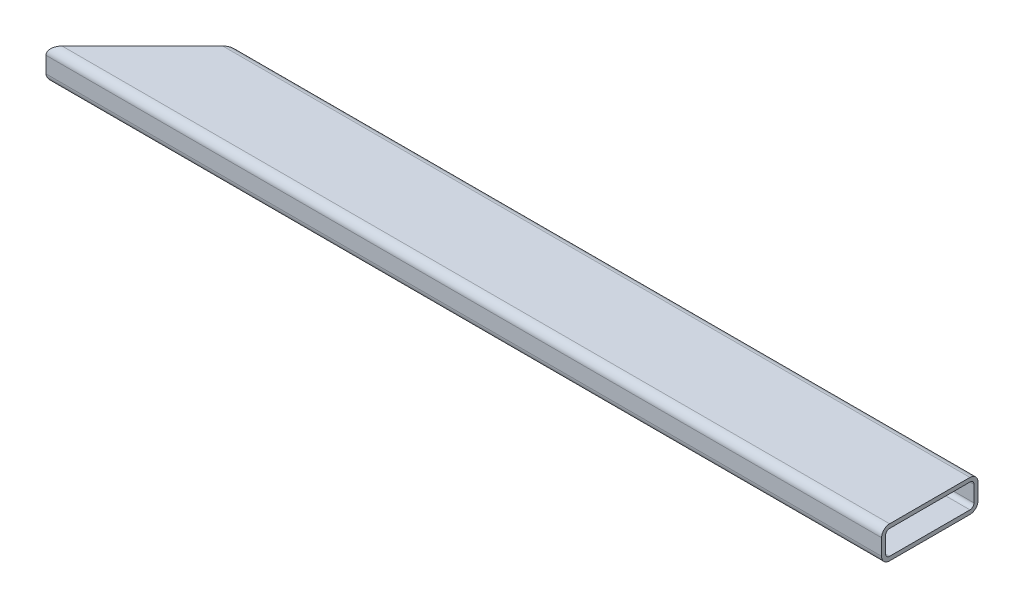
ISO-10303-21;
HEADER;
FILE_DESCRIPTION(('STEP AP214'),'2;1');
FILE_NAME('part.step','',(''),(''),'','','');
FILE_SCHEMA(('AUTOMOTIVE_DESIGN { 1 0 10303 214 1 1 1 1 }'));
ENDSEC;
DATA;
#1=APPLICATION_CONTEXT('core data for automotive mechanical design processes');
#2=APPLICATION_PROTOCOL_DEFINITION('international standard','automotive_design',2000,#1);
#3=PRODUCT_CONTEXT('',#1,'mechanical');
#4=PRODUCT('Part','Part','',(#3));
#5=PRODUCT_RELATED_PRODUCT_CATEGORY('part','',(#4));
#6=PRODUCT_DEFINITION_FORMATION('','',#4);
#7=PRODUCT_DEFINITION_CONTEXT('part definition',#1,'design');
#8=PRODUCT_DEFINITION('design','',#6,#7);
#9=PRODUCT_DEFINITION_SHAPE('','',#8);
#10=(LENGTH_UNIT() NAMED_UNIT(*) SI_UNIT(.MILLI.,.METRE.));
#11=(NAMED_UNIT(*) PLANE_ANGLE_UNIT() SI_UNIT($,.RADIAN.));
#12=(NAMED_UNIT(*) SI_UNIT($,.STERADIAN.) SOLID_ANGLE_UNIT());
#13=UNCERTAINTY_MEASURE_WITH_UNIT(LENGTH_MEASURE(1.E-05),#10,'distance_accuracy_value','');
#14=(GEOMETRIC_REPRESENTATION_CONTEXT(3) GLOBAL_UNCERTAINTY_ASSIGNED_CONTEXT((#13)) GLOBAL_UNIT_ASSIGNED_CONTEXT((#10,
#11,#12)) REPRESENTATION_CONTEXT('',''));
#15=CARTESIAN_POINT('',(0.,0.,0.));
#16=DIRECTION('',(0.,0.,1.));
#17=DIRECTION('',(1.,0.,0.));
#18=AXIS2_PLACEMENT_3D('',#15,#16,#17);
#19=CARTESIAN_POINT('',(660.4,0.,0.));
#20=DIRECTION('',(0.,0.,-1.));
#21=DIRECTION('',(-1.,0.,0.));
#22=AXIS2_PLACEMENT_3D('',#19,#20,#21);
#23=PLANE('',#22);
#24=DIRECTION('',(0.,-1.,0.));
#25=VECTOR('',#24,1.);
#26=CARTESIAN_POINT('',(0.,0.,0.));
#27=LINE('',#26,#25);
#28=CARTESIAN_POINT('',(0.,19.05,0.));
#29=VERTEX_POINT('',#28);
#30=CARTESIAN_POINT('',(0.,6.35,0.));
#31=VERTEX_POINT('',#30);
#32=EDGE_CURVE('E154',#29,#31,#27,.T.);
#33=ORIENTED_EDGE('',*,*,#32,.T.);
#34=DIRECTION('',(-1.,0.,0.));
#35=VECTOR('',#34,1.);
#36=CARTESIAN_POINT('',(660.4,6.35,0.));
#37=LINE('',#36,#35);
#38=CARTESIAN_POINT('',(660.4,6.35,0.));
#39=VERTEX_POINT('',#38);
#40=EDGE_CURVE('E44',#31,#39,#37,.F.);
#41=ORIENTED_EDGE('',*,*,#40,.T.);
#42=DIRECTION('',(0.,-1.,0.));
#43=VECTOR('',#42,1.);
#44=CARTESIAN_POINT('',(660.4,0.,0.));
#45=LINE('',#44,#43);
#46=CARTESIAN_POINT('',(660.4,19.05,0.));
#47=VERTEX_POINT('',#46);
#48=EDGE_CURVE('E186',#47,#39,#45,.T.);
#49=ORIENTED_EDGE('',*,*,#48,.F.);
#50=DIRECTION('',(-1.,0.,0.));
#51=VECTOR('',#50,1.);
#52=CARTESIAN_POINT('',(660.4,19.05,0.));
#53=LINE('',#52,#51);
#54=EDGE_CURVE('E176',#47,#29,#53,.T.);
#55=ORIENTED_EDGE('',*,*,#54,.T.);
#56=EDGE_LOOP('',(#33,#41,#49,#55));
#57=FACE_BOUND('',#56,.T.);
#58=ADVANCED_FACE('F36',(#57),#23,.F.);
#59=CARTESIAN_POINT('',(660.4,0.,0.));
#60=DIRECTION('',(0.,1.,0.));
#61=DIRECTION('',(0.,0.,1.));
#62=AXIS2_PLACEMENT_3D('',#59,#60,#61);
#63=PLANE('',#62);
#64=DIRECTION('',(-1.,0.,0.));
#65=VECTOR('',#64,1.);
#66=CARTESIAN_POINT('',(660.4,0.,-6.35));
#67=LINE('',#66,#65);
#68=CARTESIAN_POINT('',(660.4,0.,-6.35));
#69=VERTEX_POINT('',#68);
#70=CARTESIAN_POINT('',(6.35000000000007,0.,-6.35));
#71=VERTEX_POINT('',#70);
#72=EDGE_CURVE('E200',#69,#71,#67,.T.);
#73=ORIENTED_EDGE('',*,*,#72,.T.);
#74=DIRECTION('',(0.707106781186551,0.,-0.707106781186544));
#75=VECTOR('',#74,1.);
#76=CARTESIAN_POINT('',(0.,0.,0.));
#77=LINE('',#76,#75);
#78=CARTESIAN_POINT('',(69.8500000000007,0.,-69.85));
#79=VERTEX_POINT('',#78);
#80=EDGE_CURVE('E170',#71,#79,#77,.T.);
#81=ORIENTED_EDGE('',*,*,#80,.T.);
#82=DIRECTION('',(-1.,0.,0.));
#83=VECTOR('',#82,1.);
#84=CARTESIAN_POINT('',(660.4,0.,-69.85));
#85=LINE('',#84,#83);
#86=CARTESIAN_POINT('',(660.4,0.,-69.85));
#87=VERTEX_POINT('',#86);
#88=EDGE_CURVE('E202',#79,#87,#85,.F.);
#89=ORIENTED_EDGE('',*,*,#88,.T.);
#90=DIRECTION('',(0.,0.,-1.));
#91=VECTOR('',#90,1.);
#92=CARTESIAN_POINT('',(660.4,0.,0.));
#93=LINE('',#92,#91);
#94=EDGE_CURVE('E195',#69,#87,#93,.T.);
#95=ORIENTED_EDGE('',*,*,#94,.F.);
#96=EDGE_LOOP('',(#73,#81,#89,#95));
#97=FACE_BOUND('',#96,.T.);
#98=ADVANCED_FACE('F282',(#97),#63,.F.);
#99=CARTESIAN_POINT('',(660.4,0.,-76.2));
#100=DIRECTION('',(0.,0.,1.));
#101=DIRECTION('',(1.,0.,0.));
#102=AXIS2_PLACEMENT_3D('',#99,#100,#101);
#103=PLANE('',#102);
#104=DIRECTION('',(-1.,0.,0.));
#105=VECTOR('',#104,1.);
#106=CARTESIAN_POINT('',(660.4,6.35,-76.2));
#107=LINE('',#106,#105);
#108=CARTESIAN_POINT('',(660.4,6.35,-76.2));
#109=VERTEX_POINT('',#108);
#110=CARTESIAN_POINT('',(76.2000000000008,6.35,-76.2));
#111=VERTEX_POINT('',#110);
#112=EDGE_CURVE('E207',#109,#111,#107,.T.);
#113=ORIENTED_EDGE('',*,*,#112,.T.);
#114=DIRECTION('',(0.,1.,0.));
#115=VECTOR('',#114,1.);
#116=CARTESIAN_POINT('',(76.2000000000008,0.,-76.2));
#117=LINE('',#116,#115);
#118=CARTESIAN_POINT('',(76.2000000000008,19.05,-76.2));
#119=VERTEX_POINT('',#118);
#120=EDGE_CURVE('E276',#111,#119,#117,.T.);
#121=ORIENTED_EDGE('',*,*,#120,.T.);
#122=DIRECTION('',(-1.,0.,0.));
#123=VECTOR('',#122,1.);
#124=CARTESIAN_POINT('',(660.4,19.05,-76.2));
#125=LINE('',#124,#123);
#126=CARTESIAN_POINT('',(660.4,19.05,-76.2));
#127=VERTEX_POINT('',#126);
#128=EDGE_CURVE('E210',#119,#127,#125,.F.);
#129=ORIENTED_EDGE('',*,*,#128,.T.);
#130=DIRECTION('',(0.,1.,0.));
#131=VECTOR('',#130,1.);
#132=CARTESIAN_POINT('',(660.4,0.,-76.2));
#133=LINE('',#132,#131);
#134=EDGE_CURVE('E215',#109,#127,#133,.T.);
#135=ORIENTED_EDGE('',*,*,#134,.F.);
#136=EDGE_LOOP('',(#113,#121,#129,#135));
#137=FACE_BOUND('',#136,.T.);
#138=ADVANCED_FACE('F291',(#137),#103,.F.);
#139=CARTESIAN_POINT('',(660.4,25.4,0.));
#140=DIRECTION('',(0.,-1.,0.));
#141=DIRECTION('',(0.,0.,-1.));
#142=AXIS2_PLACEMENT_3D('',#139,#140,#141);
#143=PLANE('',#142);
#144=DIRECTION('',(-1.,0.,0.));
#145=VECTOR('',#144,1.);
#146=CARTESIAN_POINT('',(660.4,25.4,-69.85));
#147=LINE('',#146,#145);
#148=CARTESIAN_POINT('',(660.4,25.4,-69.85));
#149=VERTEX_POINT('',#148);
#150=CARTESIAN_POINT('',(69.8500000000007,25.4,-69.85));
#151=VERTEX_POINT('',#150);
#152=EDGE_CURVE('E169',#149,#151,#147,.T.);
#153=ORIENTED_EDGE('',*,*,#152,.T.);
#154=DIRECTION('',(0.707106781186551,0.,-0.707106781186544));
#155=VECTOR('',#154,1.);
#156=CARTESIAN_POINT('',(0.,25.4,0.));
#157=LINE('',#156,#155);
#158=CARTESIAN_POINT('',(6.35000000000007,25.4,-6.35));
#159=VERTEX_POINT('',#158);
#160=EDGE_CURVE('E151',#159,#151,#157,.T.);
#161=ORIENTED_EDGE('',*,*,#160,.F.);
#162=DIRECTION('',(-1.,0.,0.));
#163=VECTOR('',#162,1.);
#164=CARTESIAN_POINT('',(660.4,25.4,-6.35));
#165=LINE('',#164,#163);
#166=CARTESIAN_POINT('',(660.4,25.4,-6.35));
#167=VERTEX_POINT('',#166);
#168=EDGE_CURVE('E166',#159,#167,#165,.F.);
#169=ORIENTED_EDGE('',*,*,#168,.T.);
#170=DIRECTION('',(0.,0.,1.));
#171=VECTOR('',#170,1.);
#172=CARTESIAN_POINT('',(660.4,25.4,0.));
#173=LINE('',#172,#171);
#174=EDGE_CURVE('E212',#149,#167,#173,.T.);
#175=ORIENTED_EDGE('',*,*,#174,.F.);
#176=EDGE_LOOP('',(#153,#161,#169,#175));
#177=FACE_BOUND('',#176,.T.);
#178=ADVANCED_FACE('F164',(#177),#143,.F.);
#179=CARTESIAN_POINT('',(660.4,0.,0.));
#180=DIRECTION('',(-1.,0.,0.));
#181=DIRECTION('',(0.,0.,1.));
#182=AXIS2_PLACEMENT_3D('',#179,#180,#181);
#183=PLANE('',#182);
#184=DIRECTION('',(0.,0.,-1.));
#185=VECTOR('',#184,1.);
#186=CARTESIAN_POINT('',(660.4,3.175,0.));
#187=LINE('',#186,#185);
#188=CARTESIAN_POINT('',(660.4,3.175,-6.35));
#189=VERTEX_POINT('',#188);
#190=CARTESIAN_POINT('',(660.4,3.175,-69.85));
#191=VERTEX_POINT('',#190);
#192=EDGE_CURVE('E233',#189,#191,#187,.T.);
#193=ORIENTED_EDGE('',*,*,#192,.F.);
#194=CARTESIAN_POINT('',(660.4,6.35,-6.35));
#195=DIRECTION('',(-1.,0.,0.));
#196=DIRECTION('',(0.,0.,1.));
#197=AXIS2_PLACEMENT_3D('',#194,#195,#196);
#198=CIRCLE('',#197,3.175);
#199=CARTESIAN_POINT('',(660.4,6.35,-3.175));
#200=VERTEX_POINT('',#199);
#201=EDGE_CURVE('E221',#200,#189,#198,.F.);
#202=ORIENTED_EDGE('',*,*,#201,.F.);
#203=DIRECTION('',(0.,-1.,0.));
#204=VECTOR('',#203,1.);
#205=CARTESIAN_POINT('',(660.4,0.,-3.175));
#206=LINE('',#205,#204);
#207=CARTESIAN_POINT('',(660.4,19.05,-3.175));
#208=VERTEX_POINT('',#207);
#209=EDGE_CURVE('E238',#208,#200,#206,.T.);
#210=ORIENTED_EDGE('',*,*,#209,.F.);
#211=CARTESIAN_POINT('',(660.4,19.05,-6.35));
#212=DIRECTION('',(-1.,0.,0.));
#213=DIRECTION('',(0.,0.,1.));
#214=AXIS2_PLACEMENT_3D('',#211,#212,#213);
#215=CIRCLE('',#214,3.175);
#216=CARTESIAN_POINT('',(660.4,22.225,-6.35));
#217=VERTEX_POINT('',#216);
#218=EDGE_CURVE('E219',#217,#208,#215,.F.);
#219=ORIENTED_EDGE('',*,*,#218,.F.);
#220=DIRECTION('',(0.,0.,1.));
#221=VECTOR('',#220,1.);
#222=CARTESIAN_POINT('',(660.4,22.225,0.));
#223=LINE('',#222,#221);
#224=CARTESIAN_POINT('',(660.4,22.225,-69.85));
#225=VERTEX_POINT('',#224);
#226=EDGE_CURVE('E223',#225,#217,#223,.T.);
#227=ORIENTED_EDGE('',*,*,#226,.F.);
#228=CARTESIAN_POINT('',(660.4,19.05,-69.85));
#229=DIRECTION('',(-1.,0.,0.));
#230=DIRECTION('',(0.,0.,1.));
#231=AXIS2_PLACEMENT_3D('',#228,#229,#230);
#232=CIRCLE('',#231,3.175);
#233=CARTESIAN_POINT('',(660.4,19.05,-73.025));
#234=VERTEX_POINT('',#233);
#235=EDGE_CURVE('E228',#234,#225,#232,.F.);
#236=ORIENTED_EDGE('',*,*,#235,.F.);
#237=DIRECTION('',(0.,1.,0.));
#238=VECTOR('',#237,1.);
#239=CARTESIAN_POINT('',(660.4,0.,-73.025));
#240=LINE('',#239,#238);
#241=CARTESIAN_POINT('',(660.4,6.35,-73.025));
#242=VERTEX_POINT('',#241);
#243=EDGE_CURVE('E227',#242,#234,#240,.T.);
#244=ORIENTED_EDGE('',*,*,#243,.F.);
#245=CARTESIAN_POINT('',(660.4,6.35,-69.85));
#246=DIRECTION('',(-1.,0.,0.));
#247=DIRECTION('',(0.,0.,1.));
#248=AXIS2_PLACEMENT_3D('',#245,#246,#247);
#249=CIRCLE('',#248,3.175);
#250=EDGE_CURVE('E230',#191,#242,#249,.F.);
#251=ORIENTED_EDGE('',*,*,#250,.F.);
#252=EDGE_LOOP('',(#193,#202,#210,#219,#227,#236,#244,#251));
#253=FACE_BOUND('',#252,.T.);
#254=ORIENTED_EDGE('',*,*,#94,.T.);
#255=CARTESIAN_POINT('',(660.4,6.35,-69.85));
#256=DIRECTION('',(-1.,0.,0.));
#257=DIRECTION('',(0.,0.,1.));
#258=AXIS2_PLACEMENT_3D('',#255,#256,#257);
#259=CIRCLE('',#258,6.35);
#260=EDGE_CURVE('E174',#87,#109,#259,.F.);
#261=ORIENTED_EDGE('',*,*,#260,.T.);
#262=ORIENTED_EDGE('',*,*,#134,.T.);
#263=CARTESIAN_POINT('',(660.4,19.05,-69.85));
#264=DIRECTION('',(-1.,0.,0.));
#265=DIRECTION('',(0.,0.,1.));
#266=AXIS2_PLACEMENT_3D('',#263,#264,#265);
#267=CIRCLE('',#266,6.35);
#268=EDGE_CURVE('E178',#127,#149,#267,.F.);
#269=ORIENTED_EDGE('',*,*,#268,.T.);
#270=ORIENTED_EDGE('',*,*,#174,.T.);
#271=CARTESIAN_POINT('',(660.4,19.05,-6.35));
#272=DIRECTION('',(-1.,0.,0.));
#273=DIRECTION('',(0.,0.,1.));
#274=AXIS2_PLACEMENT_3D('',#271,#272,#273);
#275=CIRCLE('',#274,6.35);
#276=EDGE_CURVE('E173',#167,#47,#275,.F.);
#277=ORIENTED_EDGE('',*,*,#276,.T.);
#278=ORIENTED_EDGE('',*,*,#48,.T.);
#279=CARTESIAN_POINT('',(660.4,6.35,-6.35));
#280=DIRECTION('',(-1.,0.,0.));
#281=DIRECTION('',(0.,0.,1.));
#282=AXIS2_PLACEMENT_3D('',#279,#280,#281);
#283=CIRCLE('',#282,6.35);
#284=EDGE_CURVE('E193',#39,#69,#283,.F.);
#285=ORIENTED_EDGE('',*,*,#284,.T.);
#286=EDGE_LOOP('',(#254,#261,#262,#269,#270,#277,#278,#285));
#287=FACE_BOUND('',#286,.T.);
#288=ADVANCED_FACE('F192',(#253,#287),#183,.F.);
#289=CARTESIAN_POINT('',(660.4,6.35,-69.85));
#290=DIRECTION('',(-1.,0.,0.));
#291=DIRECTION('',(0.,0.,1.));
#292=AXIS2_PLACEMENT_3D('',#289,#290,#291);
#293=CYLINDRICAL_SURFACE('',#292,6.35);
#294=CARTESIAN_POINT('',(69.8500000000007,6.35,-69.85));
#295=DIRECTION('',(0.707106781186544,0.,0.707106781186551));
#296=DIRECTION('',(-0.707106781186551,0.,0.707106781186544));
#297=AXIS2_PLACEMENT_3D('',#294,#295,#296);
#298=ELLIPSE('',#297,8.9802561210692,6.35);
#299=EDGE_CURVE('E241',#111,#79,#298,.F.);
#300=ORIENTED_EDGE('',*,*,#299,.F.);
#301=ORIENTED_EDGE('',*,*,#112,.F.);
#302=ORIENTED_EDGE('',*,*,#260,.F.);
#303=ORIENTED_EDGE('',*,*,#88,.F.);
#304=EDGE_LOOP('',(#300,#301,#302,#303));
#305=FACE_BOUND('',#304,.T.);
#306=ADVANCED_FACE('F286',(#305),#293,.T.);
#307=CARTESIAN_POINT('',(660.4,19.05,-69.85));
#308=DIRECTION('',(-1.,0.,0.));
#309=DIRECTION('',(0.,0.,1.));
#310=AXIS2_PLACEMENT_3D('',#307,#308,#309);
#311=CYLINDRICAL_SURFACE('',#310,6.35);
#312=CARTESIAN_POINT('',(69.8500000000007,19.05,-69.85));
#313=DIRECTION('',(0.707106781186544,0.,0.707106781186551));
#314=DIRECTION('',(-0.707106781186551,0.,0.707106781186544));
#315=AXIS2_PLACEMENT_3D('',#312,#313,#314);
#316=ELLIPSE('',#315,8.9802561210692,6.35);
#317=EDGE_CURVE('E259',#151,#119,#316,.F.);
#318=ORIENTED_EDGE('',*,*,#317,.F.);
#319=ORIENTED_EDGE('',*,*,#152,.F.);
#320=ORIENTED_EDGE('',*,*,#268,.F.);
#321=ORIENTED_EDGE('',*,*,#128,.F.);
#322=EDGE_LOOP('',(#318,#319,#320,#321));
#323=FACE_BOUND('',#322,.T.);
#324=ADVANCED_FACE('F294',(#323),#311,.T.);
#325=CARTESIAN_POINT('',(660.4,6.35,-6.35));
#326=DIRECTION('',(-1.,0.,0.));
#327=DIRECTION('',(0.,0.,1.));
#328=AXIS2_PLACEMENT_3D('',#325,#326,#327);
#329=CYLINDRICAL_SURFACE('',#328,6.35);
#330=CARTESIAN_POINT('',(6.35000000000008,6.35,-6.35));
#331=DIRECTION('',(0.707106781186544,0.,0.707106781186551));
#332=DIRECTION('',(-0.707106781186551,0.,0.707106781186544));
#333=AXIS2_PLACEMENT_3D('',#330,#331,#332);
#334=ELLIPSE('',#333,8.9802561210692,6.35);
#335=EDGE_CURVE('E159',#71,#31,#334,.F.);
#336=ORIENTED_EDGE('',*,*,#335,.F.);
#337=ORIENTED_EDGE('',*,*,#72,.F.);
#338=ORIENTED_EDGE('',*,*,#284,.F.);
#339=ORIENTED_EDGE('',*,*,#40,.F.);
#340=EDGE_LOOP('',(#336,#337,#338,#339));
#341=FACE_BOUND('',#340,.T.);
#342=ADVANCED_FACE('F198',(#341),#329,.T.);
#343=CARTESIAN_POINT('',(660.4,19.05,-6.35));
#344=DIRECTION('',(-1.,0.,0.));
#345=DIRECTION('',(0.,0.,1.));
#346=AXIS2_PLACEMENT_3D('',#343,#344,#345);
#347=CYLINDRICAL_SURFACE('',#346,6.35);
#348=CARTESIAN_POINT('',(6.35000000000008,19.05,-6.35));
#349=DIRECTION('',(0.707106781186544,0.,0.707106781186551));
#350=DIRECTION('',(-0.707106781186551,0.,0.707106781186544));
#351=AXIS2_PLACEMENT_3D('',#348,#349,#350);
#352=ELLIPSE('',#351,8.9802561210692,6.35);
#353=EDGE_CURVE('E148',#29,#159,#352,.F.);
#354=ORIENTED_EDGE('',*,*,#353,.F.);
#355=ORIENTED_EDGE('',*,*,#54,.F.);
#356=ORIENTED_EDGE('',*,*,#276,.F.);
#357=ORIENTED_EDGE('',*,*,#168,.F.);
#358=EDGE_LOOP('',(#354,#355,#356,#357));
#359=FACE_BOUND('',#358,.T.);
#360=ADVANCED_FACE('F38',(#359),#347,.T.);
#361=CARTESIAN_POINT('',(660.4,0.,-3.175));
#362=DIRECTION('',(0.,0.,-1.));
#363=DIRECTION('',(-1.,0.,0.));
#364=AXIS2_PLACEMENT_3D('',#361,#362,#363);
#365=PLANE('',#364);
#366=DIRECTION('',(0.,-1.,0.));
#367=VECTOR('',#366,1.);
#368=CARTESIAN_POINT('',(3.17500000000004,0.,-3.175));
#369=LINE('',#368,#367);
#370=CARTESIAN_POINT('',(3.17500000000004,19.05,-3.175));
#371=VERTEX_POINT('',#370);
#372=CARTESIAN_POINT('',(3.17500000000004,6.35,-3.175));
#373=VERTEX_POINT('',#372);
#374=EDGE_CURVE('E273',#371,#373,#369,.T.);
#375=ORIENTED_EDGE('',*,*,#374,.F.);
#376=DIRECTION('',(-1.,0.,0.));
#377=VECTOR('',#376,1.);
#378=CARTESIAN_POINT('',(660.4,19.05,-3.175));
#379=LINE('',#378,#377);
#380=EDGE_CURVE('E246',#208,#371,#379,.T.);
#381=ORIENTED_EDGE('',*,*,#380,.F.);
#382=ORIENTED_EDGE('',*,*,#209,.T.);
#383=DIRECTION('',(-1.,0.,0.));
#384=VECTOR('',#383,1.);
#385=CARTESIAN_POINT('',(660.4,6.35,-3.175));
#386=LINE('',#385,#384);
#387=EDGE_CURVE('E58',#373,#200,#386,.F.);
#388=ORIENTED_EDGE('',*,*,#387,.F.);
#389=EDGE_LOOP('',(#375,#381,#382,#388));
#390=FACE_BOUND('',#389,.T.);
#391=ADVANCED_FACE('F342',(#390),#365,.T.);
#392=CARTESIAN_POINT('',(660.4,3.175,0.));
#393=DIRECTION('',(0.,1.,0.));
#394=DIRECTION('',(0.,0.,1.));
#395=AXIS2_PLACEMENT_3D('',#392,#393,#394);
#396=PLANE('',#395);
#397=DIRECTION('',(0.707106781186551,0.,-0.707106781186544));
#398=VECTOR('',#397,1.);
#399=CARTESIAN_POINT('',(330.200000000003,3.175,-330.2));
#400=LINE('',#399,#398);
#401=CARTESIAN_POINT('',(6.35000000000008,3.175,-6.35));
#402=VERTEX_POINT('',#401);
#403=CARTESIAN_POINT('',(69.8500000000007,3.175,-69.85));
#404=VERTEX_POINT('',#403);
#405=EDGE_CURVE('E264',#402,#404,#400,.T.);
#406=ORIENTED_EDGE('',*,*,#405,.F.);
#407=DIRECTION('',(1.,0.,0.));
#408=VECTOR('',#407,1.);
#409=CARTESIAN_POINT('',(660.4,3.175,-6.35));
#410=LINE('',#409,#408);
#411=EDGE_CURVE('E251',#189,#402,#410,.F.);
#412=ORIENTED_EDGE('',*,*,#411,.F.);
#413=ORIENTED_EDGE('',*,*,#192,.T.);
#414=DIRECTION('',(1.,0.,0.));
#415=VECTOR('',#414,1.);
#416=CARTESIAN_POINT('',(660.4,3.175,-69.85));
#417=LINE('',#416,#415);
#418=EDGE_CURVE('E222',#404,#191,#417,.T.);
#419=ORIENTED_EDGE('',*,*,#418,.F.);
#420=EDGE_LOOP('',(#406,#412,#413,#419));
#421=FACE_BOUND('',#420,.T.);
#422=ADVANCED_FACE('F338',(#421),#396,.T.);
#423=CARTESIAN_POINT('',(660.4,0.,-73.025));
#424=DIRECTION('',(0.,0.,1.));
#425=DIRECTION('',(1.,0.,0.));
#426=AXIS2_PLACEMENT_3D('',#423,#424,#425);
#427=PLANE('',#426);
#428=DIRECTION('',(0.,1.,0.));
#429=VECTOR('',#428,1.);
#430=CARTESIAN_POINT('',(73.0250000000008,0.,-73.025));
#431=LINE('',#430,#429);
#432=CARTESIAN_POINT('',(73.0250000000008,6.35,-73.025));
#433=VERTEX_POINT('',#432);
#434=CARTESIAN_POINT('',(73.0250000000008,19.05,-73.025));
#435=VERTEX_POINT('',#434);
#436=EDGE_CURVE('E266',#433,#435,#431,.T.);
#437=ORIENTED_EDGE('',*,*,#436,.F.);
#438=DIRECTION('',(1.,0.,0.));
#439=VECTOR('',#438,1.);
#440=CARTESIAN_POINT('',(660.4,6.35,-73.025));
#441=LINE('',#440,#439);
#442=EDGE_CURVE('E248',#242,#433,#441,.F.);
#443=ORIENTED_EDGE('',*,*,#442,.F.);
#444=ORIENTED_EDGE('',*,*,#243,.T.);
#445=DIRECTION('',(1.,0.,0.));
#446=VECTOR('',#445,1.);
#447=CARTESIAN_POINT('',(660.4,19.05,-73.025));
#448=LINE('',#447,#446);
#449=EDGE_CURVE('E226',#435,#234,#448,.T.);
#450=ORIENTED_EDGE('',*,*,#449,.F.);
#451=EDGE_LOOP('',(#437,#443,#444,#450));
#452=FACE_BOUND('',#451,.T.);
#453=ADVANCED_FACE('F334',(#452),#427,.T.);
#454=CARTESIAN_POINT('',(660.4,22.225,0.));
#455=DIRECTION('',(0.,-1.,0.));
#456=DIRECTION('',(0.,0.,-1.));
#457=AXIS2_PLACEMENT_3D('',#454,#455,#456);
#458=PLANE('',#457);
#459=DIRECTION('',(-0.707106781186551,0.,0.707106781186544));
#460=VECTOR('',#459,1.);
#461=CARTESIAN_POINT('',(330.200000000003,22.225,-330.2));
#462=LINE('',#461,#460);
#463=CARTESIAN_POINT('',(69.8500000000007,22.225,-69.85));
#464=VERTEX_POINT('',#463);
#465=CARTESIAN_POINT('',(6.35000000000008,22.225,-6.35));
#466=VERTEX_POINT('',#465);
#467=EDGE_CURVE('E51',#464,#466,#462,.T.);
#468=ORIENTED_EDGE('',*,*,#467,.F.);
#469=DIRECTION('',(1.,0.,0.));
#470=VECTOR('',#469,1.);
#471=CARTESIAN_POINT('',(660.4,22.225,-69.85));
#472=LINE('',#471,#470);
#473=EDGE_CURVE('E243',#225,#464,#472,.F.);
#474=ORIENTED_EDGE('',*,*,#473,.F.);
#475=ORIENTED_EDGE('',*,*,#226,.T.);
#476=DIRECTION('',(1.,0.,0.));
#477=VECTOR('',#476,1.);
#478=CARTESIAN_POINT('',(660.4,22.225,-6.35));
#479=LINE('',#478,#477);
#480=EDGE_CURVE('E235',#466,#217,#479,.T.);
#481=ORIENTED_EDGE('',*,*,#480,.F.);
#482=EDGE_LOOP('',(#468,#474,#475,#481));
#483=FACE_BOUND('',#482,.T.);
#484=ADVANCED_FACE('F330',(#483),#458,.T.);
#485=CARTESIAN_POINT('',(660.4,6.35,-69.85));
#486=DIRECTION('',(-1.,0.,0.));
#487=DIRECTION('',(0.,0.,1.));
#488=AXIS2_PLACEMENT_3D('',#485,#486,#487);
#489=CYLINDRICAL_SURFACE('',#488,3.175);
#490=ORIENTED_EDGE('',*,*,#442,.T.);
#491=CARTESIAN_POINT('',(69.8500000000007,6.35,-69.85));
#492=DIRECTION('',(0.707106781186544,0.,0.707106781186551));
#493=DIRECTION('',(-0.707106781186551,0.,0.707106781186544));
#494=AXIS2_PLACEMENT_3D('',#491,#492,#493);
#495=ELLIPSE('',#494,4.4901280605346,3.175);
#496=EDGE_CURVE('E160',#433,#404,#495,.F.);
#497=ORIENTED_EDGE('',*,*,#496,.T.);
#498=ORIENTED_EDGE('',*,*,#418,.T.);
#499=ORIENTED_EDGE('',*,*,#250,.T.);
#500=EDGE_LOOP('',(#490,#497,#498,#499));
#501=FACE_BOUND('',#500,.T.);
#502=ADVANCED_FACE('F326',(#501),#489,.F.);
#503=CARTESIAN_POINT('',(660.4,19.05,-69.85));
#504=DIRECTION('',(-1.,0.,0.));
#505=DIRECTION('',(0.,0.,1.));
#506=AXIS2_PLACEMENT_3D('',#503,#504,#505);
#507=CYLINDRICAL_SURFACE('',#506,3.175);
#508=ORIENTED_EDGE('',*,*,#473,.T.);
#509=CARTESIAN_POINT('',(69.8500000000007,19.05,-69.85));
#510=DIRECTION('',(0.707106781186544,0.,0.707106781186551));
#511=DIRECTION('',(-0.707106781186551,0.,0.707106781186544));
#512=AXIS2_PLACEMENT_3D('',#509,#510,#511);
#513=ELLIPSE('',#512,4.4901280605346,3.175);
#514=EDGE_CURVE('E268',#464,#435,#513,.F.);
#515=ORIENTED_EDGE('',*,*,#514,.T.);
#516=ORIENTED_EDGE('',*,*,#449,.T.);
#517=ORIENTED_EDGE('',*,*,#235,.T.);
#518=EDGE_LOOP('',(#508,#515,#516,#517));
#519=FACE_BOUND('',#518,.T.);
#520=ADVANCED_FACE('F323',(#519),#507,.F.);
#521=CARTESIAN_POINT('',(660.4,6.35,-6.35));
#522=DIRECTION('',(-1.,0.,0.));
#523=DIRECTION('',(0.,0.,1.));
#524=AXIS2_PLACEMENT_3D('',#521,#522,#523);
#525=CYLINDRICAL_SURFACE('',#524,3.175);
#526=ORIENTED_EDGE('',*,*,#411,.T.);
#527=CARTESIAN_POINT('',(6.35000000000008,6.35,-6.35));
#528=DIRECTION('',(0.707106781186544,0.,0.707106781186551));
#529=DIRECTION('',(-0.707106781186551,0.,0.707106781186544));
#530=AXIS2_PLACEMENT_3D('',#527,#528,#529);
#531=ELLIPSE('',#530,4.4901280605346,3.175);
#532=EDGE_CURVE('E271',#402,#373,#531,.F.);
#533=ORIENTED_EDGE('',*,*,#532,.T.);
#534=ORIENTED_EDGE('',*,*,#387,.T.);
#535=ORIENTED_EDGE('',*,*,#201,.T.);
#536=EDGE_LOOP('',(#526,#533,#534,#535));
#537=FACE_BOUND('',#536,.T.);
#538=ADVANCED_FACE('F319',(#537),#525,.F.);
#539=CARTESIAN_POINT('',(660.4,19.05,-6.35));
#540=DIRECTION('',(-1.,0.,0.));
#541=DIRECTION('',(0.,0.,1.));
#542=AXIS2_PLACEMENT_3D('',#539,#540,#541);
#543=CYLINDRICAL_SURFACE('',#542,3.175);
#544=ORIENTED_EDGE('',*,*,#380,.T.);
#545=CARTESIAN_POINT('',(6.35000000000008,19.05,-6.35));
#546=DIRECTION('',(0.707106781186544,0.,0.707106781186551));
#547=DIRECTION('',(-0.707106781186551,0.,0.707106781186544));
#548=AXIS2_PLACEMENT_3D('',#545,#546,#547);
#549=ELLIPSE('',#548,4.4901280605346,3.175);
#550=EDGE_CURVE('E11',#371,#466,#549,.F.);
#551=ORIENTED_EDGE('',*,*,#550,.T.);
#552=ORIENTED_EDGE('',*,*,#480,.T.);
#553=ORIENTED_EDGE('',*,*,#218,.T.);
#554=EDGE_LOOP('',(#544,#551,#552,#553));
#555=FACE_BOUND('',#554,.T.);
#556=ADVANCED_FACE('F316',(#555),#543,.F.);
#557=CARTESIAN_POINT('',(0.,0.,0.));
#558=DIRECTION('',(0.707106781186544,0.,0.707106781186551));
#559=DIRECTION('',(0.707106781186551,0.,-0.707106781186544));
#560=AXIS2_PLACEMENT_3D('',#557,#558,#559);
#561=PLANE('',#560);
#562=ORIENTED_EDGE('',*,*,#299,.T.);
#563=ORIENTED_EDGE('',*,*,#80,.F.);
#564=ORIENTED_EDGE('',*,*,#335,.T.);
#565=ORIENTED_EDGE('',*,*,#32,.F.);
#566=ORIENTED_EDGE('',*,*,#353,.T.);
#567=ORIENTED_EDGE('',*,*,#160,.T.);
#568=ORIENTED_EDGE('',*,*,#317,.T.);
#569=ORIENTED_EDGE('',*,*,#120,.F.);
#570=EDGE_LOOP('',(#562,#563,#564,#565,#566,#567,#568,#569));
#571=FACE_BOUND('',#570,.T.);
#572=ORIENTED_EDGE('',*,*,#436,.T.);
#573=ORIENTED_EDGE('',*,*,#514,.F.);
#574=ORIENTED_EDGE('',*,*,#467,.T.);
#575=ORIENTED_EDGE('',*,*,#550,.F.);
#576=ORIENTED_EDGE('',*,*,#374,.T.);
#577=ORIENTED_EDGE('',*,*,#532,.F.);
#578=ORIENTED_EDGE('',*,*,#405,.T.);
#579=ORIENTED_EDGE('',*,*,#496,.F.);
#580=EDGE_LOOP('',(#572,#573,#574,#575,#576,#577,#578,#579));
#581=FACE_BOUND('',#580,.T.);
#582=ADVANCED_FACE('F150',(#571,#581),#561,.F.);
#583=CLOSED_SHELL('',(#58,#98,#138,#178,#288,#306,#324,#342,#360,#391,#422,#453,#484,#502,#520,
#538,#556,#582));
#584=MANIFOLD_SOLID_BREP('B2',#583);
#585=ADVANCED_BREP_SHAPE_REPRESENTATION('',(#18,#584),#14);
#586=SHAPE_DEFINITION_REPRESENTATION(#9,#585);
ENDSEC;
END-ISO-10303-21;
